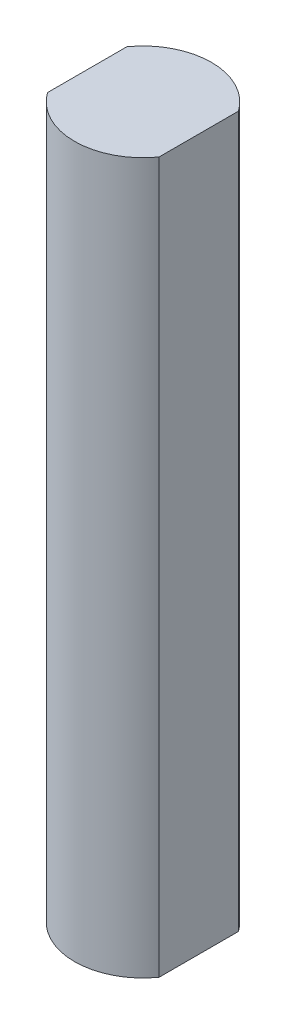
ISO-10303-21;
HEADER;
FILE_DESCRIPTION(('STEP AP214'),'2;1');
FILE_NAME('part.step','',(''),(''),'','','');
FILE_SCHEMA(('AUTOMOTIVE_DESIGN { 1 0 10303 214 1 1 1 1 }'));
ENDSEC;
DATA;
#1=APPLICATION_CONTEXT('core data for automotive mechanical design processes');
#2=APPLICATION_PROTOCOL_DEFINITION('international standard','automotive_design',2000,#1);
#3=PRODUCT_CONTEXT('',#1,'mechanical');
#4=PRODUCT('Part','Part','',(#3));
#5=PRODUCT_RELATED_PRODUCT_CATEGORY('part','',(#4));
#6=PRODUCT_DEFINITION_FORMATION('','',#4);
#7=PRODUCT_DEFINITION_CONTEXT('part definition',#1,'design');
#8=PRODUCT_DEFINITION('design','',#6,#7);
#9=PRODUCT_DEFINITION_SHAPE('','',#8);
#10=(LENGTH_UNIT() NAMED_UNIT(*) SI_UNIT(.MILLI.,.METRE.));
#11=(NAMED_UNIT(*) PLANE_ANGLE_UNIT() SI_UNIT($,.RADIAN.));
#12=(NAMED_UNIT(*) SI_UNIT($,.STERADIAN.) SOLID_ANGLE_UNIT());
#13=UNCERTAINTY_MEASURE_WITH_UNIT(LENGTH_MEASURE(1.E-05),#10,'distance_accuracy_value','');
#14=(GEOMETRIC_REPRESENTATION_CONTEXT(3) GLOBAL_UNCERTAINTY_ASSIGNED_CONTEXT((#13)) GLOBAL_UNIT_ASSIGNED_CONTEXT((#10,
#11,#12)) REPRESENTATION_CONTEXT('',''));
#15=CARTESIAN_POINT('',(0.,0.,0.));
#16=DIRECTION('',(0.,0.,1.));
#17=DIRECTION('',(1.,0.,0.));
#18=AXIS2_PLACEMENT_3D('',#15,#16,#17);
#19=CARTESIAN_POINT('',(0.,45.466,0.));
#20=DIRECTION('',(0.,-1.,0.));
#21=DIRECTION('',(0.,0.,-1.));
#22=AXIS2_PLACEMENT_3D('',#19,#20,#21);
#23=CYLINDRICAL_SURFACE('',#22,4.3815);
#24=DIRECTION('',(0.,1.,0.));
#25=VECTOR('',#24,1.);
#26=CARTESIAN_POINT('',(-3.57014597040513,-2.794,-2.54));
#27=LINE('',#26,#25);
#28=CARTESIAN_POINT('',(-3.57014597040513,0.,-2.54));
#29=VERTEX_POINT('',#28);
#30=CARTESIAN_POINT('',(-3.57014597040513,45.466,-2.54));
#31=VERTEX_POINT('',#30);
#32=EDGE_CURVE('E45',#29,#31,#27,.T.);
#33=ORIENTED_EDGE('',*,*,#32,.T.);
#34=CARTESIAN_POINT('',(0.,45.466,0.));
#35=DIRECTION('',(0.,1.,0.));
#36=DIRECTION('',(0.,0.,1.));
#37=AXIS2_PLACEMENT_3D('',#34,#35,#36);
#38=CIRCLE('',#37,4.3815);
#39=CARTESIAN_POINT('',(3.57014597040513,45.466,-2.54));
#40=VERTEX_POINT('',#39);
#41=EDGE_CURVE('E82',#40,#31,#38,.T.);
#42=ORIENTED_EDGE('',*,*,#41,.F.);
#43=DIRECTION('',(0.,1.,0.));
#44=VECTOR('',#43,1.);
#45=CARTESIAN_POINT('',(3.57014597040513,-2.794,-2.54));
#46=LINE('',#45,#44);
#47=CARTESIAN_POINT('',(3.57014597040513,0.,-2.54));
#48=VERTEX_POINT('',#47);
#49=EDGE_CURVE('E93',#48,#40,#46,.T.);
#50=ORIENTED_EDGE('',*,*,#49,.F.);
#51=CARTESIAN_POINT('',(0.,0.,0.));
#52=DIRECTION('',(0.,1.,0.));
#53=DIRECTION('',(0.,0.,1.));
#54=AXIS2_PLACEMENT_3D('',#51,#52,#53);
#55=CIRCLE('',#54,4.3815);
#56=EDGE_CURVE('E84',#48,#29,#55,.T.);
#57=ORIENTED_EDGE('',*,*,#56,.T.);
#58=EDGE_LOOP('',(#33,#42,#50,#57));
#59=FACE_BOUND('',#58,.T.);
#60=ADVANCED_FACE('F32',(#59),#23,.T.);
#61=DIRECTION('',(0.,1.,0.));
#62=VECTOR('',#61,1.);
#63=CARTESIAN_POINT('',(-3.57014597040513,-2.794,2.54));
#64=LINE('',#63,#62);
#65=CARTESIAN_POINT('',(-3.57014597040513,0.,2.54));
#66=VERTEX_POINT('',#65);
#67=CARTESIAN_POINT('',(-3.57014597040513,45.466,2.54));
#68=VERTEX_POINT('',#67);
#69=EDGE_CURVE('E72',#66,#68,#64,.T.);
#70=ORIENTED_EDGE('',*,*,#69,.F.);
#71=CARTESIAN_POINT('',(3.57014597040513,0.,2.54));
#72=VERTEX_POINT('',#71);
#73=EDGE_CURVE('E95',#66,#72,#55,.T.);
#74=ORIENTED_EDGE('',*,*,#73,.T.);
#75=DIRECTION('',(0.,1.,0.));
#76=VECTOR('',#75,1.);
#77=CARTESIAN_POINT('',(3.57014597040513,-2.794,2.54));
#78=LINE('',#77,#76);
#79=CARTESIAN_POINT('',(3.57014597040513,45.466,2.54));
#80=VERTEX_POINT('',#79);
#81=EDGE_CURVE('E53',#72,#80,#78,.T.);
#82=ORIENTED_EDGE('',*,*,#81,.T.);
#83=EDGE_CURVE('E89',#68,#80,#38,.T.);
#84=ORIENTED_EDGE('',*,*,#83,.F.);
#85=EDGE_LOOP('',(#70,#74,#82,#84));
#86=FACE_BOUND('',#85,.T.);
#87=ADVANCED_FACE('F104',(#86),#23,.T.);
#88=CARTESIAN_POINT('',(0.,45.466,0.));
#89=DIRECTION('',(0.,1.,0.));
#90=DIRECTION('',(0.,0.,1.));
#91=AXIS2_PLACEMENT_3D('',#88,#89,#90);
#92=PLANE('',#91);
#93=ORIENTED_EDGE('',*,*,#41,.T.);
#94=DIRECTION('',(0.,0.,1.));
#95=VECTOR('',#94,1.);
#96=CARTESIAN_POINT('',(-3.57014597040513,45.466,0.));
#97=LINE('',#96,#95);
#98=EDGE_CURVE('E69',#31,#68,#97,.T.);
#99=ORIENTED_EDGE('',*,*,#98,.T.);
#100=ORIENTED_EDGE('',*,*,#83,.T.);
#101=DIRECTION('',(0.,0.,1.));
#102=VECTOR('',#101,1.);
#103=CARTESIAN_POINT('',(3.57014597040513,45.466,0.));
#104=LINE('',#103,#102);
#105=EDGE_CURVE('E88',#40,#80,#104,.T.);
#106=ORIENTED_EDGE('',*,*,#105,.F.);
#107=EDGE_LOOP('',(#93,#99,#100,#106));
#108=FACE_BOUND('',#107,.T.);
#109=ADVANCED_FACE('F87',(#108),#92,.T.);
#110=CARTESIAN_POINT('',(0.,0.,0.));
#111=DIRECTION('',(0.,1.,0.));
#112=DIRECTION('',(0.,0.,1.));
#113=AXIS2_PLACEMENT_3D('',#110,#111,#112);
#114=PLANE('',#113);
#115=DIRECTION('',(0.,0.,1.));
#116=VECTOR('',#115,1.);
#117=CARTESIAN_POINT('',(-3.57014597040513,0.,0.));
#118=LINE('',#117,#116);
#119=EDGE_CURVE('E11',#29,#66,#118,.T.);
#120=ORIENTED_EDGE('',*,*,#119,.F.);
#121=ORIENTED_EDGE('',*,*,#56,.F.);
#122=DIRECTION('',(0.,0.,1.));
#123=VECTOR('',#122,1.);
#124=CARTESIAN_POINT('',(3.57014597040513,0.,0.));
#125=LINE('',#124,#123);
#126=EDGE_CURVE('E39',#48,#72,#125,.T.);
#127=ORIENTED_EDGE('',*,*,#126,.T.);
#128=ORIENTED_EDGE('',*,*,#73,.F.);
#129=EDGE_LOOP('',(#120,#121,#127,#128));
#130=FACE_BOUND('',#129,.T.);
#131=ADVANCED_FACE('F103',(#130),#114,.F.);
#132=CARTESIAN_POINT('',(3.57014597040513,-2.794,0.));
#133=DIRECTION('',(-1.,0.,0.));
#134=DIRECTION('',(0.,0.,1.));
#135=AXIS2_PLACEMENT_3D('',#132,#133,#134);
#136=PLANE('',#135);
#137=ORIENTED_EDGE('',*,*,#49,.T.);
#138=ORIENTED_EDGE('',*,*,#105,.T.);
#139=ORIENTED_EDGE('',*,*,#81,.F.);
#140=ORIENTED_EDGE('',*,*,#126,.F.);
#141=EDGE_LOOP('',(#137,#138,#139,#140));
#142=FACE_BOUND('',#141,.T.);
#143=ADVANCED_FACE('F101',(#142),#136,.F.);
#144=CARTESIAN_POINT('',(-3.57014597040513,-2.794,0.));
#145=DIRECTION('',(-1.,0.,0.));
#146=DIRECTION('',(0.,0.,1.));
#147=AXIS2_PLACEMENT_3D('',#144,#145,#146);
#148=PLANE('',#147);
#149=ORIENTED_EDGE('',*,*,#119,.T.);
#150=ORIENTED_EDGE('',*,*,#69,.T.);
#151=ORIENTED_EDGE('',*,*,#98,.F.);
#152=ORIENTED_EDGE('',*,*,#32,.F.);
#153=EDGE_LOOP('',(#149,#150,#151,#152));
#154=FACE_BOUND('',#153,.T.);
#155=ADVANCED_FACE('F70',(#154),#148,.T.);
#156=CLOSED_SHELL('',(#60,#87,#109,#131,#143,#155));
#157=MANIFOLD_SOLID_BREP('B2',#156);
#158=ADVANCED_BREP_SHAPE_REPRESENTATION('',(#18,#157),#14);
#159=SHAPE_DEFINITION_REPRESENTATION(#9,#158);
ENDSEC;
END-ISO-10303-21;
